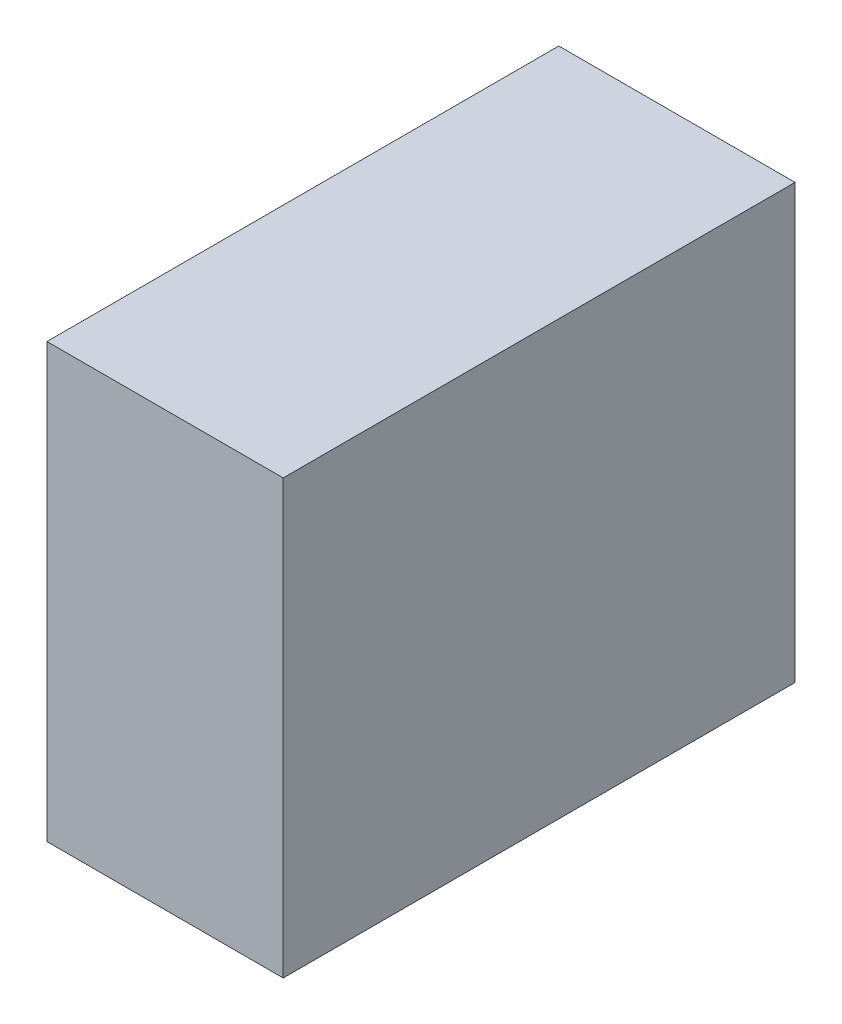
ISO-10303-21;
HEADER;
FILE_DESCRIPTION(('STEP AP214'),'2;1');
FILE_NAME('part.step','',(''),(''),'','','');
FILE_SCHEMA(('AUTOMOTIVE_DESIGN { 1 0 10303 214 1 1 1 1 }'));
ENDSEC;
DATA;
#1=APPLICATION_CONTEXT('core data for automotive mechanical design processes');
#2=APPLICATION_PROTOCOL_DEFINITION('international standard','automotive_design',2000,#1);
#3=PRODUCT_CONTEXT('',#1,'mechanical');
#4=PRODUCT('Part','Part','',(#3));
#5=PRODUCT_RELATED_PRODUCT_CATEGORY('part','',(#4));
#6=PRODUCT_DEFINITION_FORMATION('','',#4);
#7=PRODUCT_DEFINITION_CONTEXT('part definition',#1,'design');
#8=PRODUCT_DEFINITION('design','',#6,#7);
#9=PRODUCT_DEFINITION_SHAPE('','',#8);
#10=(LENGTH_UNIT() NAMED_UNIT(*) SI_UNIT(.MILLI.,.METRE.));
#11=(NAMED_UNIT(*) PLANE_ANGLE_UNIT() SI_UNIT($,.RADIAN.));
#12=(NAMED_UNIT(*) SI_UNIT($,.STERADIAN.) SOLID_ANGLE_UNIT());
#13=UNCERTAINTY_MEASURE_WITH_UNIT(LENGTH_MEASURE(1.E-05),#10,'distance_accuracy_value','');
#14=(GEOMETRIC_REPRESENTATION_CONTEXT(3) GLOBAL_UNCERTAINTY_ASSIGNED_CONTEXT((#13)) GLOBAL_UNIT_ASSIGNED_CONTEXT((#10,
#11,#12)) REPRESENTATION_CONTEXT('',''));
#15=CARTESIAN_POINT('',(0.,0.,0.));
#16=DIRECTION('',(0.,0.,1.));
#17=DIRECTION('',(1.,0.,0.));
#18=AXIS2_PLACEMENT_3D('',#15,#16,#17);
#19=CARTESIAN_POINT('',(0.2999994,-0.5499989,0.));
#20=DIRECTION('',(-1.,0.,0.));
#21=DIRECTION('',(0.,0.,1.));
#22=AXIS2_PLACEMENT_3D('',#19,#20,#21);
#23=PLANE('',#22);
#24=DIRECTION('',(0.,0.,-1.));
#25=VECTOR('',#24,1.);
#26=CARTESIAN_POINT('',(0.2999994,0.5499989,0.));
#27=LINE('',#26,#25);
#28=CARTESIAN_POINT('',(0.2999994,0.5499989,0.));
#29=VERTEX_POINT('',#28);
#30=CARTESIAN_POINT('',(0.2999994,0.5499989,1.29999994));
#31=VERTEX_POINT('',#30);
#32=EDGE_CURVE('E19',#29,#31,#27,.F.);
#33=ORIENTED_EDGE('',*,*,#32,.T.);
#34=DIRECTION('',(0.,1.,0.));
#35=VECTOR('',#34,1.);
#36=CARTESIAN_POINT('',(0.2999994,0.5499989,1.29999994));
#37=LINE('',#36,#35);
#38=CARTESIAN_POINT('',(0.2999994,-0.5499989,1.29999994));
#39=VERTEX_POINT('',#38);
#40=EDGE_CURVE('E54',#31,#39,#37,.F.);
#41=ORIENTED_EDGE('',*,*,#40,.T.);
#42=DIRECTION('',(0.,0.,1.));
#43=VECTOR('',#42,1.);
#44=CARTESIAN_POINT('',(0.2999994,-0.5499989,0.));
#45=LINE('',#44,#43);
#46=CARTESIAN_POINT('',(0.2999994,-0.5499989,0.));
#47=VERTEX_POINT('',#46);
#48=EDGE_CURVE('E75',#39,#47,#45,.F.);
#49=ORIENTED_EDGE('',*,*,#48,.T.);
#50=DIRECTION('',(0.,1.,0.));
#51=VECTOR('',#50,1.);
#52=CARTESIAN_POINT('',(0.2999994,0.5499989,0.));
#53=LINE('',#52,#51);
#54=EDGE_CURVE('E57',#29,#47,#53,.F.);
#55=ORIENTED_EDGE('',*,*,#54,.F.);
#56=EDGE_LOOP('',(#33,#41,#49,#55));
#57=FACE_BOUND('',#56,.T.);
#58=ADVANCED_FACE('F16',(#57),#23,.F.);
#59=CARTESIAN_POINT('',(0.2999994,0.5499989,0.));
#60=DIRECTION('',(0.,-1.,0.));
#61=DIRECTION('',(0.,0.,-1.));
#62=AXIS2_PLACEMENT_3D('',#59,#60,#61);
#63=PLANE('',#62);
#64=DIRECTION('',(0.,0.,-1.));
#65=VECTOR('',#64,1.);
#66=CARTESIAN_POINT('',(-0.2999994,0.5499989,0.));
#67=LINE('',#66,#65);
#68=CARTESIAN_POINT('',(-0.2999994,0.5499989,0.));
#69=VERTEX_POINT('',#68);
#70=CARTESIAN_POINT('',(-0.2999994,0.5499989,1.29999994));
#71=VERTEX_POINT('',#70);
#72=EDGE_CURVE('E72',#69,#71,#67,.F.);
#73=ORIENTED_EDGE('',*,*,#72,.T.);
#74=DIRECTION('',(-1.,0.,0.));
#75=VECTOR('',#74,1.);
#76=CARTESIAN_POINT('',(-0.2999994,0.5499989,1.29999994));
#77=LINE('',#76,#75);
#78=EDGE_CURVE('E62',#71,#31,#77,.F.);
#79=ORIENTED_EDGE('',*,*,#78,.T.);
#80=ORIENTED_EDGE('',*,*,#32,.F.);
#81=DIRECTION('',(-1.,0.,0.));
#82=VECTOR('',#81,1.);
#83=CARTESIAN_POINT('',(-0.2999994,0.5499989,0.));
#84=LINE('',#83,#82);
#85=EDGE_CURVE('E77',#69,#29,#84,.F.);
#86=ORIENTED_EDGE('',*,*,#85,.F.);
#87=EDGE_LOOP('',(#73,#79,#80,#86));
#88=FACE_BOUND('',#87,.T.);
#89=ADVANCED_FACE('F71',(#88),#63,.F.);
#90=CARTESIAN_POINT('',(-0.2999994,0.5499989,1.29999994));
#91=DIRECTION('',(0.,0.,-1.));
#92=DIRECTION('',(-1.,0.,0.));
#93=AXIS2_PLACEMENT_3D('',#90,#91,#92);
#94=PLANE('',#93);
#95=DIRECTION('',(1.,0.,0.));
#96=VECTOR('',#95,1.);
#97=CARTESIAN_POINT('',(-0.2999994,-0.5499989,1.29999994));
#98=LINE('',#97,#96);
#99=CARTESIAN_POINT('',(-0.2999994,-0.5499989,1.29999994));
#100=VERTEX_POINT('',#99);
#101=EDGE_CURVE('E68',#100,#39,#98,.T.);
#102=ORIENTED_EDGE('',*,*,#101,.T.);
#103=ORIENTED_EDGE('',*,*,#40,.F.);
#104=ORIENTED_EDGE('',*,*,#78,.F.);
#105=DIRECTION('',(0.,1.,0.));
#106=VECTOR('',#105,1.);
#107=CARTESIAN_POINT('',(-0.2999994,0.5499989,1.29999994));
#108=LINE('',#107,#106);
#109=EDGE_CURVE('E82',#71,#100,#108,.F.);
#110=ORIENTED_EDGE('',*,*,#109,.T.);
#111=EDGE_LOOP('',(#102,#103,#104,#110));
#112=FACE_BOUND('',#111,.T.);
#113=ADVANCED_FACE('F65',(#112),#94,.F.);
#114=CARTESIAN_POINT('',(-0.2999994,-0.5499989,0.));
#115=DIRECTION('',(0.,1.,0.));
#116=DIRECTION('',(0.,0.,1.));
#117=AXIS2_PLACEMENT_3D('',#114,#115,#116);
#118=PLANE('',#117);
#119=ORIENTED_EDGE('',*,*,#48,.F.);
#120=ORIENTED_EDGE('',*,*,#101,.F.);
#121=DIRECTION('',(0.,0.,-1.));
#122=VECTOR('',#121,1.);
#123=CARTESIAN_POINT('',(-0.2999994,-0.5499989,0.));
#124=LINE('',#123,#122);
#125=CARTESIAN_POINT('',(-0.2999994,-0.5499989,0.));
#126=VERTEX_POINT('',#125);
#127=EDGE_CURVE('E25',#100,#126,#124,.T.);
#128=ORIENTED_EDGE('',*,*,#127,.T.);
#129=DIRECTION('',(-1.,0.,0.));
#130=VECTOR('',#129,1.);
#131=CARTESIAN_POINT('',(-0.2999994,-0.5499989,0.));
#132=LINE('',#131,#130);
#133=EDGE_CURVE('E33',#47,#126,#132,.T.);
#134=ORIENTED_EDGE('',*,*,#133,.F.);
#135=EDGE_LOOP('',(#119,#120,#128,#134));
#136=FACE_BOUND('',#135,.T.);
#137=ADVANCED_FACE('F87',(#136),#118,.F.);
#138=CARTESIAN_POINT('',(-0.2999994,0.5499989,0.));
#139=DIRECTION('',(0.,0.,-1.));
#140=DIRECTION('',(-1.,0.,0.));
#141=AXIS2_PLACEMENT_3D('',#138,#139,#140);
#142=PLANE('',#141);
#143=ORIENTED_EDGE('',*,*,#133,.T.);
#144=DIRECTION('',(0.,1.,0.));
#145=VECTOR('',#144,1.);
#146=CARTESIAN_POINT('',(-0.2999994,0.5499989,0.));
#147=LINE('',#146,#145);
#148=EDGE_CURVE('E11',#126,#69,#147,.T.);
#149=ORIENTED_EDGE('',*,*,#148,.T.);
#150=ORIENTED_EDGE('',*,*,#85,.T.);
#151=ORIENTED_EDGE('',*,*,#54,.T.);
#152=EDGE_LOOP('',(#143,#149,#150,#151));
#153=FACE_BOUND('',#152,.T.);
#154=ADVANCED_FACE('F90',(#153),#142,.T.);
#155=CARTESIAN_POINT('',(-0.2999994,0.5499989,0.));
#156=DIRECTION('',(1.,0.,0.));
#157=DIRECTION('',(0.,0.,-1.));
#158=AXIS2_PLACEMENT_3D('',#155,#156,#157);
#159=PLANE('',#158);
#160=ORIENTED_EDGE('',*,*,#127,.F.);
#161=ORIENTED_EDGE('',*,*,#109,.F.);
#162=ORIENTED_EDGE('',*,*,#72,.F.);
#163=ORIENTED_EDGE('',*,*,#148,.F.);
#164=EDGE_LOOP('',(#160,#161,#162,#163));
#165=FACE_BOUND('',#164,.T.);
#166=ADVANCED_FACE('F89',(#165),#159,.F.);
#167=CLOSED_SHELL('',(#58,#89,#113,#137,#154,#166));
#168=MANIFOLD_SOLID_BREP('B1',#167);
#169=ADVANCED_BREP_SHAPE_REPRESENTATION('',(#18,#168),#14);
#170=SHAPE_DEFINITION_REPRESENTATION(#9,#169);
ENDSEC;
END-ISO-10303-21;
